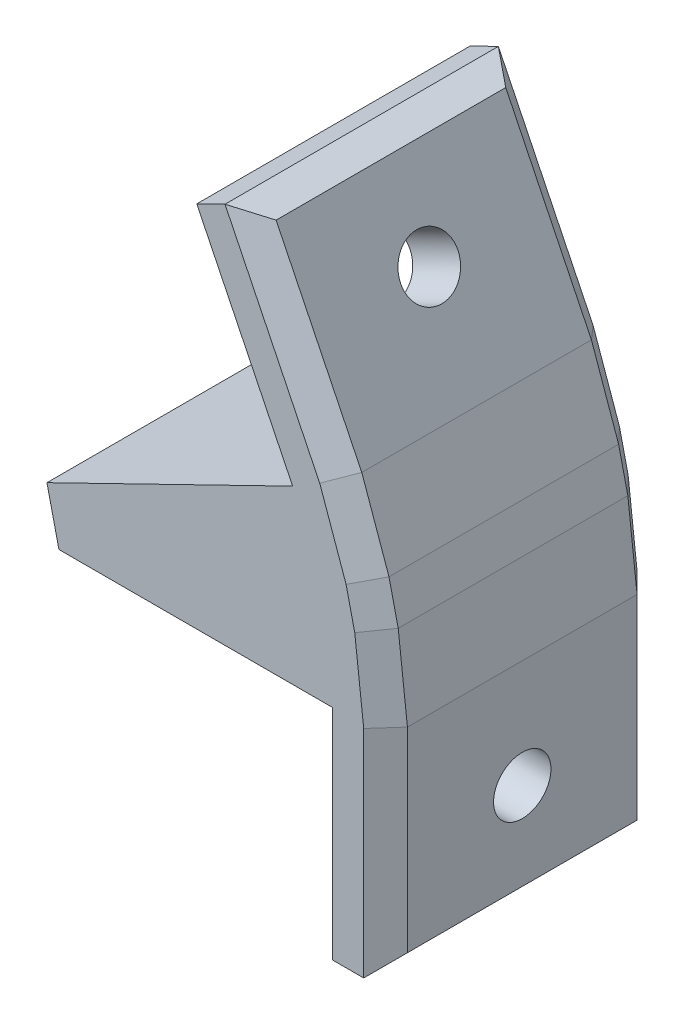
ISO-10303-21;
HEADER;
FILE_DESCRIPTION(('STEP AP214'),'2;1');
FILE_NAME('part.step','',(''),(''),'','','');
FILE_SCHEMA(('AUTOMOTIVE_DESIGN { 1 0 10303 214 1 1 1 1 }'));
ENDSEC;
DATA;
#1=APPLICATION_CONTEXT('core data for automotive mechanical design processes');
#2=APPLICATION_PROTOCOL_DEFINITION('international standard','automotive_design',2000,#1);
#3=PRODUCT_CONTEXT('',#1,'mechanical');
#4=PRODUCT('Part','Part','',(#3));
#5=PRODUCT_RELATED_PRODUCT_CATEGORY('part','',(#4));
#6=PRODUCT_DEFINITION_FORMATION('','',#4);
#7=PRODUCT_DEFINITION_CONTEXT('part definition',#1,'design');
#8=PRODUCT_DEFINITION('design','',#6,#7);
#9=PRODUCT_DEFINITION_SHAPE('','',#8);
#10=(LENGTH_UNIT() NAMED_UNIT(*) SI_UNIT(.MILLI.,.METRE.));
#11=(NAMED_UNIT(*) PLANE_ANGLE_UNIT() SI_UNIT($,.RADIAN.));
#12=(NAMED_UNIT(*) SI_UNIT($,.STERADIAN.) SOLID_ANGLE_UNIT());
#13=UNCERTAINTY_MEASURE_WITH_UNIT(LENGTH_MEASURE(1.E-05),#10,'distance_accuracy_value','');
#14=(GEOMETRIC_REPRESENTATION_CONTEXT(3) GLOBAL_UNCERTAINTY_ASSIGNED_CONTEXT((#13)) GLOBAL_UNIT_ASSIGNED_CONTEXT((#10,
#11,#12)) REPRESENTATION_CONTEXT('',''));
#15=CARTESIAN_POINT('',(0.,0.,0.));
#16=DIRECTION('',(0.,0.,1.));
#17=DIRECTION('',(1.,0.,0.));
#18=AXIS2_PLACEMENT_3D('',#15,#16,#17);
#19=CARTESIAN_POINT('',(0.,0.,20.));
#20=DIRECTION('',(0.,0.,-1.));
#21=DIRECTION('',(-1.,0.,0.));
#22=AXIS2_PLACEMENT_3D('',#19,#20,#21);
#23=PLANE('',#22);
#24=DIRECTION('',(-0.333806859233767,0.94264149109218,0.));
#25=VECTOR('',#24,1.);
#26=CARTESIAN_POINT('',(19.0500213590096,11.8295183172805,20.));
#27=LINE('',#26,#25);
#28=CARTESIAN_POINT('',(21.0096600790083,6.29566928475386,20.));
#29=VERTEX_POINT('',#28);
#30=CARTESIAN_POINT('',(19.0803492424098,11.7438750165536,20.));
#31=VERTEX_POINT('',#30);
#32=EDGE_CURVE('E44',#29,#31,#27,.T.);
#33=ORIENTED_EDGE('',*,*,#32,.T.);
#34=DIRECTION('',(-0.438371146789075,0.898794046299168,0.));
#35=VECTOR('',#34,1.);
#36=CARTESIAN_POINT('',(12.1501618621858,25.9528648250914,20.));
#37=LINE('',#36,#35);
#38=CARTESIAN_POINT('',(12.1501618621858,25.9528648250914,20.));
#39=VERTEX_POINT('',#38);
#40=EDGE_CURVE('E11',#31,#39,#37,.T.);
#41=ORIENTED_EDGE('',*,*,#40,.T.);
#42=DIRECTION('',(-0.898794046299169,-0.438371146789073,0.));
#43=VECTOR('',#42,1.);
#44=CARTESIAN_POINT('',(10.0852002837801,24.9457157691665,20.));
#45=LINE('',#44,#43);
#46=CARTESIAN_POINT('',(10.0852002837801,24.9457157691665,20.));
#47=VERTEX_POINT('',#46);
#48=EDGE_CURVE('E297',#39,#47,#45,.T.);
#49=ORIENTED_EDGE('',*,*,#48,.T.);
#50=DIRECTION('',(0.438371146789074,-0.898794046299169,0.));
#51=VECTOR('',#50,1.);
#52=CARTESIAN_POINT('',(17.0991386324052,10.5650110283798,20.));
#53=LINE('',#52,#51);
#54=CARTESIAN_POINT('',(17.0991386324052,10.5650110283798,20.));
#55=VERTEX_POINT('',#54);
#56=EDGE_CURVE('E301',#47,#55,#53,.T.);
#57=ORIENTED_EDGE('',*,*,#56,.T.);
#58=DIRECTION('',(0.89879404629917,0.438371146789072,0.));
#59=VECTOR('',#58,1.);
#60=CARTESIAN_POINT('',(-0.876742293578144,1.79758809259834,20.));
#61=LINE('',#60,#59);
#62=CARTESIAN_POINT('',(-0.876742293578144,1.79758809259834,20.));
#63=VERTEX_POINT('',#62);
#64=EDGE_CURVE('E168',#63,#55,#61,.T.);
#65=ORIENTED_EDGE('',*,*,#64,.F.);
#66=DIRECTION('',(0.224951054343862,-0.974370064785236,0.));
#67=VECTOR('',#66,1.);
#68=CARTESIAN_POINT('',(0.,-2.,20.));
#69=LINE('',#68,#67);
#70=CARTESIAN_POINT('',(0.,-2.,20.));
#71=VERTEX_POINT('',#70);
#72=EDGE_CURVE('E163',#63,#71,#69,.T.);
#73=ORIENTED_EDGE('',*,*,#72,.T.);
#74=DIRECTION('',(-1.,0.,0.));
#75=VECTOR('',#74,1.);
#76=CARTESIAN_POINT('',(0.,-2.,20.));
#77=LINE('',#76,#75);
#78=CARTESIAN_POINT('',(20.,-2.,20.));
#79=VERTEX_POINT('',#78);
#80=EDGE_CURVE('E169',#79,#71,#77,.T.);
#81=ORIENTED_EDGE('',*,*,#80,.F.);
#82=DIRECTION('',(0.,-1.,0.));
#83=VECTOR('',#82,1.);
#84=CARTESIAN_POINT('',(20.,-2.,20.));
#85=LINE('',#84,#83);
#86=CARTESIAN_POINT('',(20.,-18.,20.));
#87=VERTEX_POINT('',#86);
#88=EDGE_CURVE('E279',#79,#87,#85,.T.);
#89=ORIENTED_EDGE('',*,*,#88,.T.);
#90=DIRECTION('',(1.,0.,0.));
#91=VECTOR('',#90,1.);
#92=CARTESIAN_POINT('',(20.,-18.,20.));
#93=LINE('',#92,#91);
#94=CARTESIAN_POINT('',(22.297480259141,-18.,20.));
#95=VERTEX_POINT('',#94);
#96=EDGE_CURVE('E284',#87,#95,#93,.T.);
#97=ORIENTED_EDGE('',*,*,#96,.T.);
#98=DIRECTION('',(0.,1.,0.));
#99=VECTOR('',#98,1.);
#100=CARTESIAN_POINT('',(22.297480259141,-2.10019578262518,20.));
#101=LINE('',#100,#99);
#102=CARTESIAN_POINT('',(22.297480259141,-2.19105036682883,20.));
#103=VERTEX_POINT('',#102);
#104=EDGE_CURVE('E241',#95,#103,#101,.T.);
#105=ORIENTED_EDGE('',*,*,#104,.T.);
#106=DIRECTION('',(-0.113203213767904,0.993571855676588,0.));
#107=VECTOR('',#106,1.);
#108=CARTESIAN_POINT('',(21.6329121270268,3.64178926970276,20.));
#109=LINE('',#108,#107);
#110=CARTESIAN_POINT('',(21.6431971579443,3.55151871187811,20.));
#111=VERTEX_POINT('',#110);
#112=EDGE_CURVE('E243',#103,#111,#109,.T.);
#113=ORIENTED_EDGE('',*,*,#112,.T.);
#114=DIRECTION('',(-0.224951054343862,0.974370064785236,0.));
#115=VECTOR('',#114,1.);
#116=CARTESIAN_POINT('',(20.9892222444996,6.38419527185088,20.));
#117=LINE('',#116,#115);
#118=EDGE_CURVE('E55',#111,#29,#117,.T.);
#119=ORIENTED_EDGE('',*,*,#118,.T.);
#120=EDGE_LOOP('',(#33,#41,#49,#57,#65,#73,#81,#89,#97,#105,#113,#119));
#121=FACE_BOUND('',#120,.T.);
#122=ADVANCED_FACE('F35',(#121),#23,.F.);
#123=CARTESIAN_POINT('',(0.,0.,0.));
#124=DIRECTION('',(0.,0.,-1.));
#125=DIRECTION('',(-1.,0.,0.));
#126=AXIS2_PLACEMENT_3D('',#123,#124,#125);
#127=PLANE('',#126);
#128=DIRECTION('',(0.113203213767904,-0.993571855676588,0.));
#129=VECTOR('',#128,1.);
#130=CARTESIAN_POINT('',(21.7652992268245,2.47984260727553,0.));
#131=LINE('',#130,#129);
#132=CARTESIAN_POINT('',(21.6431971579443,3.55151871187808,0.));
#133=VERTEX_POINT('',#132);
#134=CARTESIAN_POINT('',(22.297480259141,-2.19105036682883,0.));
#135=VERTEX_POINT('',#134);
#136=EDGE_CURVE('E217',#133,#135,#131,.T.);
#137=ORIENTED_EDGE('',*,*,#136,.T.);
#138=DIRECTION('',(0.,-1.,0.));
#139=VECTOR('',#138,1.);
#140=CARTESIAN_POINT('',(22.297480259141,0.,0.));
#141=LINE('',#140,#139);
#142=CARTESIAN_POINT('',(22.297480259141,-18.,0.));
#143=VERTEX_POINT('',#142);
#144=EDGE_CURVE('E219',#135,#143,#141,.T.);
#145=ORIENTED_EDGE('',*,*,#144,.T.);
#146=DIRECTION('',(1.,0.,0.));
#147=VECTOR('',#146,1.);
#148=CARTESIAN_POINT('',(20.,-18.,0.));
#149=LINE('',#148,#147);
#150=CARTESIAN_POINT('',(20.,-18.,0.));
#151=VERTEX_POINT('',#150);
#152=EDGE_CURVE('E292',#151,#143,#149,.T.);
#153=ORIENTED_EDGE('',*,*,#152,.F.);
#154=DIRECTION('',(0.,-1.,0.));
#155=VECTOR('',#154,1.);
#156=CARTESIAN_POINT('',(20.,0.,0.));
#157=LINE('',#156,#155);
#158=CARTESIAN_POINT('',(20.,-2.,0.));
#159=VERTEX_POINT('',#158);
#160=EDGE_CURVE('E289',#159,#151,#157,.T.);
#161=ORIENTED_EDGE('',*,*,#160,.F.);
#162=DIRECTION('',(1.,0.,0.));
#163=VECTOR('',#162,1.);
#164=CARTESIAN_POINT('',(0.,-2.,0.));
#165=LINE('',#164,#163);
#166=CARTESIAN_POINT('',(0.,-2.,0.));
#167=VERTEX_POINT('',#166);
#168=EDGE_CURVE('E178',#167,#159,#165,.T.);
#169=ORIENTED_EDGE('',*,*,#168,.F.);
#170=DIRECTION('',(0.224951054343862,-0.974370064785236,0.));
#171=VECTOR('',#170,1.);
#172=CARTESIAN_POINT('',(0.,-2.,0.));
#173=LINE('',#172,#171);
#174=CARTESIAN_POINT('',(-0.876742293578144,1.79758809259834,0.));
#175=VERTEX_POINT('',#174);
#176=EDGE_CURVE('E160',#175,#167,#173,.T.);
#177=ORIENTED_EDGE('',*,*,#176,.F.);
#178=DIRECTION('',(-0.89879404629917,-0.438371146789072,0.));
#179=VECTOR('',#178,1.);
#180=CARTESIAN_POINT('',(-0.876742293578144,1.79758809259834,0.));
#181=LINE('',#180,#179);
#182=CARTESIAN_POINT('',(17.0991386324052,10.5650110283798,0.));
#183=VERTEX_POINT('',#182);
#184=EDGE_CURVE('E175',#183,#175,#181,.T.);
#185=ORIENTED_EDGE('',*,*,#184,.F.);
#186=DIRECTION('',(0.438371146789074,-0.898794046299169,0.));
#187=VECTOR('',#186,1.);
#188=CARTESIAN_POINT('',(17.9758809259834,8.76742293578144,0.));
#189=LINE('',#188,#187);
#190=CARTESIAN_POINT('',(10.0852002837801,24.9457157691665,0.));
#191=VERTEX_POINT('',#190);
#192=EDGE_CURVE('E298',#191,#183,#189,.T.);
#193=ORIENTED_EDGE('',*,*,#192,.F.);
#194=DIRECTION('',(-0.898794046299169,-0.438371146789073,0.));
#195=VECTOR('',#194,1.);
#196=CARTESIAN_POINT('',(10.0852002837801,24.9457157691665,0.));
#197=LINE('',#196,#195);
#198=CARTESIAN_POINT('',(12.1501618621858,25.9528648250914,0.));
#199=VERTEX_POINT('',#198);
#200=EDGE_CURVE('E300',#199,#191,#197,.T.);
#201=ORIENTED_EDGE('',*,*,#200,.F.);
#202=DIRECTION('',(0.438371146789075,-0.898794046299168,0.));
#203=VECTOR('',#202,1.);
#204=CARTESIAN_POINT('',(20.0408425043891,9.77457199170637,0.));
#205=LINE('',#204,#203);
#206=CARTESIAN_POINT('',(19.0803492424098,11.7438750165536,0.));
#207=VERTEX_POINT('',#206);
#208=EDGE_CURVE('E211',#199,#207,#205,.T.);
#209=ORIENTED_EDGE('',*,*,#208,.T.);
#210=DIRECTION('',(0.333806859233767,-0.94264149109218,0.));
#211=VECTOR('',#210,1.);
#212=CARTESIAN_POINT('',(20.6496128085976,7.3124114110921,0.));
#213=LINE('',#212,#211);
#214=CARTESIAN_POINT('',(21.0096600790083,6.29566928475387,0.));
#215=VERTEX_POINT('',#214);
#216=EDGE_CURVE('E213',#207,#215,#213,.T.);
#217=ORIENTED_EDGE('',*,*,#216,.T.);
#218=DIRECTION('',(0.224951054343862,-0.974370064785236,0.));
#219=VECTOR('',#218,1.);
#220=CARTESIAN_POINT('',(21.3264286184763,4.92359399831599,0.));
#221=LINE('',#220,#219);
#222=EDGE_CURVE('E215',#215,#133,#221,.T.);
#223=ORIENTED_EDGE('',*,*,#222,.T.);
#224=EDGE_LOOP('',(#137,#145,#153,#161,#169,#177,#185,#193,#201,#209,#217,#223));
#225=FACE_BOUND('',#224,.T.);
#226=ADVANCED_FACE('F173',(#225),#127,.T.);
#227=CARTESIAN_POINT('',(-0.876742293578144,1.79758809259834,0.));
#228=DIRECTION('',(0.438371146789072,-0.89879404629917,0.));
#229=DIRECTION('',(0.89879404629917,0.438371146789072,0.));
#230=AXIS2_PLACEMENT_3D('',#227,#228,#229);
#231=PLANE('',#230);
#232=DIRECTION('',(0.,0.,1.));
#233=VECTOR('',#232,1.);
#234=CARTESIAN_POINT('',(-0.876742293578144,1.79758809259834,20.));
#235=LINE('',#234,#233);
#236=EDGE_CURVE('E157',#175,#63,#235,.T.);
#237=ORIENTED_EDGE('',*,*,#236,.T.);
#238=ORIENTED_EDGE('',*,*,#64,.T.);
#239=DIRECTION('',(0.,0.,-1.));
#240=VECTOR('',#239,1.);
#241=CARTESIAN_POINT('',(17.0991386324052,10.5650110283798,20.));
#242=LINE('',#241,#240);
#243=EDGE_CURVE('E184',#55,#183,#242,.T.);
#244=ORIENTED_EDGE('',*,*,#243,.T.);
#245=ORIENTED_EDGE('',*,*,#184,.T.);
#246=EDGE_LOOP('',(#237,#238,#244,#245));
#247=FACE_BOUND('',#246,.T.);
#248=ADVANCED_FACE('F183',(#247),#231,.F.);
#249=CARTESIAN_POINT('',(0.,-2.,0.));
#250=DIRECTION('',(0.,-1.,0.));
#251=DIRECTION('',(0.,0.,-1.));
#252=AXIS2_PLACEMENT_3D('',#249,#250,#251);
#253=PLANE('',#252);
#254=DIRECTION('',(0.,0.,-1.));
#255=VECTOR('',#254,1.);
#256=CARTESIAN_POINT('',(0.,-2.,20.));
#257=LINE('',#256,#255);
#258=EDGE_CURVE('E309',#71,#167,#257,.T.);
#259=ORIENTED_EDGE('',*,*,#258,.T.);
#260=ORIENTED_EDGE('',*,*,#168,.T.);
#261=DIRECTION('',(0.,0.,1.));
#262=VECTOR('',#261,1.);
#263=CARTESIAN_POINT('',(20.,-2.,20.));
#264=LINE('',#263,#262);
#265=EDGE_CURVE('E312',#159,#79,#264,.T.);
#266=ORIENTED_EDGE('',*,*,#265,.T.);
#267=ORIENTED_EDGE('',*,*,#80,.T.);
#268=EDGE_LOOP('',(#259,#260,#266,#267));
#269=FACE_BOUND('',#268,.T.);
#270=ADVANCED_FACE('F383',(#269),#253,.T.);
#271=CARTESIAN_POINT('',(22.8854207221327,5.28351568526617,0.));
#272=DIRECTION('',(0.974370064785236,0.224951054343862,0.));
#273=DIRECTION('',(-0.224951054343862,0.974370064785236,0.));
#274=AXIS2_PLACEMENT_3D('',#271,#272,#273);
#275=PLANE('',#274);
#276=DIRECTION('',(0.,0.,-1.));
#277=VECTOR('',#276,1.);
#278=CARTESIAN_POINT('',(23.2226270961093,3.82291441173129,0.));
#279=LINE('',#278,#277);
#280=CARTESIAN_POINT('',(23.2226270961093,3.82291441173129,18.4));
#281=VERTEX_POINT('',#280);
#282=CARTESIAN_POINT('',(23.2226270961093,3.82291441173129,1.6));
#283=VERTEX_POINT('',#282);
#284=EDGE_CURVE('E188',#281,#283,#279,.T.);
#285=ORIENTED_EDGE('',*,*,#284,.T.);
#286=DIRECTION('',(-0.224951054343862,0.974370064785236,0.));
#287=VECTOR('',#286,1.);
#288=CARTESIAN_POINT('',(22.8854207221327,5.28351568526617,1.6));
#289=LINE('',#288,#287);
#290=CARTESIAN_POINT('',(22.548214348156,6.74411695880101,1.6));
#291=VERTEX_POINT('',#290);
#292=EDGE_CURVE('E227',#283,#291,#289,.T.);
#293=ORIENTED_EDGE('',*,*,#292,.T.);
#294=DIRECTION('',(0.,0.,1.));
#295=VECTOR('',#294,1.);
#296=CARTESIAN_POINT('',(22.548214348156,6.74411695880101,0.));
#297=LINE('',#296,#295);
#298=CARTESIAN_POINT('',(22.548214348156,6.74411695880101,18.4));
#299=VERTEX_POINT('',#298);
#300=EDGE_CURVE('E185',#291,#299,#297,.T.);
#301=ORIENTED_EDGE('',*,*,#300,.T.);
#302=DIRECTION('',(0.224951054343862,-0.974370064785236,0.));
#303=VECTOR('',#302,1.);
#304=CARTESIAN_POINT('',(23.2226270961093,3.8229144117314,18.4));
#305=LINE('',#304,#303);
#306=EDGE_CURVE('E225',#299,#281,#305,.T.);
#307=ORIENTED_EDGE('',*,*,#306,.T.);
#308=EDGE_LOOP('',(#285,#293,#301,#307));
#309=FACE_BOUND('',#308,.T.);
#310=ADVANCED_FACE('F385',(#309),#275,.T.);
#311=CARTESIAN_POINT('',(17.0991386324052,10.5650110283798,0.));
#312=DIRECTION('',(-0.898794046299168,-0.438371146789074,0.));
#313=DIRECTION('',(0.438371146789074,-0.898794046299168,0.));
#314=AXIS2_PLACEMENT_3D('',#311,#312,#313);
#315=PLANE('',#314);
#316=CARTESIAN_POINT('',(13.5921694580926,17.7553633987732,10.));
#317=DIRECTION('',(-0.898794046299169,-0.438371146789074,0.));
#318=DIRECTION('',(0.438371146789074,-0.898794046299169,0.));
#319=AXIS2_PLACEMENT_3D('',#316,#317,#318);
#320=CIRCLE('',#319,2.1);
#321=CARTESIAN_POINT('',(14.5127488663497,15.8678959015449,10.));
#322=VERTEX_POINT('',#321);
#323=EDGE_CURVE('E358',#322,#322,#320,.T.);
#324=ORIENTED_EDGE('',*,*,#323,.F.);
#325=EDGE_LOOP('',(#324));
#326=FACE_BOUND('',#325,.T.);
#327=ORIENTED_EDGE('',*,*,#243,.F.);
#328=ORIENTED_EDGE('',*,*,#56,.F.);
#329=DIRECTION('',(0.,0.,1.));
#330=VECTOR('',#329,1.);
#331=CARTESIAN_POINT('',(10.0852002837801,24.9457157691665,0.));
#332=LINE('',#331,#330);
#333=EDGE_CURVE('E303',#191,#47,#332,.T.);
#334=ORIENTED_EDGE('',*,*,#333,.F.);
#335=ORIENTED_EDGE('',*,*,#192,.T.);
#336=EDGE_LOOP('',(#327,#328,#334,#335));
#337=FACE_BOUND('',#336,.T.);
#338=ADVANCED_FACE('F320',(#326,#337),#315,.T.);
#339=CARTESIAN_POINT('',(10.0852002837801,24.9457157691665,0.));
#340=DIRECTION('',(-0.438371146789073,0.898794046299169,0.));
#341=DIRECTION('',(-0.898794046299169,-0.438371146789073,0.));
#342=AXIS2_PLACEMENT_3D('',#339,#340,#341);
#343=PLANE('',#342);
#344=ORIENTED_EDGE('',*,*,#48,.F.);
#345=DIRECTION('',(0.,0.,-1.));
#346=VECTOR('',#345,1.);
#347=CARTESIAN_POINT('',(12.1501618621858,25.9528648250914,0.));
#348=LINE('',#347,#346);
#349=EDGE_CURVE('E239',#39,#199,#348,.T.);
#350=ORIENTED_EDGE('',*,*,#349,.T.);
#351=ORIENTED_EDGE('',*,*,#200,.T.);
#352=ORIENTED_EDGE('',*,*,#333,.T.);
#353=EDGE_LOOP('',(#344,#350,#351,#352));
#354=FACE_BOUND('',#353,.T.);
#355=ADVANCED_FACE('F479',(#354),#343,.T.);
#356=CARTESIAN_POINT('',(13.5882323362645,26.6542586599539,0.));
#357=DIRECTION('',(0.898794046299168,0.438371146789074,0.));
#358=DIRECTION('',(-0.438371146789074,0.898794046299168,0.));
#359=AXIS2_PLACEMENT_3D('',#356,#357,#358);
#360=PLANE('',#359);
#361=CARTESIAN_POINT('',(17.0952015105771,19.4639062895606,10.));
#362=DIRECTION('',(0.898794046299168,0.438371146789074,0.));
#363=DIRECTION('',(-0.438371146789074,0.898794046299168,0.));
#364=AXIS2_PLACEMENT_3D('',#361,#362,#363);
#365=CIRCLE('',#364,2.1);
#366=CARTESIAN_POINT('',(16.17462210232,21.3513737867888,10.));
#367=VERTEX_POINT('',#366);
#368=EDGE_CURVE('E39',#367,#367,#365,.T.);
#369=ORIENTED_EDGE('',*,*,#368,.F.);
#370=EDGE_LOOP('',(#369));
#371=FACE_BOUND('',#370,.T.);
#372=DIRECTION('',(0.,0.,-1.));
#373=VECTOR('',#372,1.);
#374=CARTESIAN_POINT('',(20.5582477447571,12.3636092920545,0.));
#375=LINE('',#374,#373);
#376=CARTESIAN_POINT('',(20.5582477447571,12.3636092920545,18.4));
#377=VERTEX_POINT('',#376);
#378=CARTESIAN_POINT('',(20.5582477447571,12.3636092920545,1.6));
#379=VERTEX_POINT('',#378);
#380=EDGE_CURVE('E198',#377,#379,#375,.T.);
#381=ORIENTED_EDGE('',*,*,#380,.T.);
#382=DIRECTION('',(-0.438371146789074,0.898794046299168,0.));
#383=VECTOR('',#382,1.);
#384=CARTESIAN_POINT('',(13.5882323362645,26.6542586599539,1.6));
#385=LINE('',#384,#383);
#386=CARTESIAN_POINT('',(14.289626171127,25.2161881858752,1.6));
#387=VERTEX_POINT('',#386);
#388=EDGE_CURVE('E237',#379,#387,#385,.T.);
#389=ORIENTED_EDGE('',*,*,#388,.T.);
#390=DIRECTION('',(0.,0.,1.));
#391=VECTOR('',#390,1.);
#392=CARTESIAN_POINT('',(14.289626171127,25.2161881858752,0.));
#393=LINE('',#392,#391);
#394=CARTESIAN_POINT('',(14.289626171127,25.2161881858752,18.4));
#395=VERTEX_POINT('',#394);
#396=EDGE_CURVE('E235',#387,#395,#393,.T.);
#397=ORIENTED_EDGE('',*,*,#396,.T.);
#398=DIRECTION('',(0.438371146789074,-0.898794046299168,0.));
#399=VECTOR('',#398,1.);
#400=CARTESIAN_POINT('',(20.5582477447571,12.3636092920545,18.4));
#401=LINE('',#400,#399);
#402=EDGE_CURVE('E233',#395,#377,#401,.T.);
#403=ORIENTED_EDGE('',*,*,#402,.T.);
#404=EDGE_LOOP('',(#381,#389,#397,#403));
#405=FACE_BOUND('',#404,.T.);
#406=ADVANCED_FACE('F471',(#371,#405),#360,.T.);
#407=CARTESIAN_POINT('',(23.897480259141,-18.,0.));
#408=DIRECTION('',(1.,0.,0.));
#409=DIRECTION('',(0.,1.,0.));
#410=AXIS2_PLACEMENT_3D('',#407,#408,#409);
#411=PLANE('',#410);
#412=CARTESIAN_POINT('',(23.897480259141,-10.,10.));
#413=DIRECTION('',(-1.,0.,0.));
#414=DIRECTION('',(0.,-1.,0.));
#415=AXIS2_PLACEMENT_3D('',#412,#413,#414);
#416=CIRCLE('',#415,2.1);
#417=CARTESIAN_POINT('',(23.897480259141,-12.1,10.));
#418=VERTEX_POINT('',#417);
#419=EDGE_CURVE('E361',#418,#418,#416,.T.);
#420=ORIENTED_EDGE('',*,*,#419,.T.);
#421=EDGE_LOOP('',(#420));
#422=FACE_BOUND('',#421,.T.);
#423=DIRECTION('',(0.,0.,-1.));
#424=VECTOR('',#423,1.);
#425=CARTESIAN_POINT('',(23.897480259141,-16.4,0.));
#426=LINE('',#425,#424);
#427=CARTESIAN_POINT('',(23.897480259141,-16.4,18.4));
#428=VERTEX_POINT('',#427);
#429=CARTESIAN_POINT('',(23.897480259141,-16.4,1.6));
#430=VERTEX_POINT('',#429);
#431=EDGE_CURVE('E206',#428,#430,#426,.T.);
#432=ORIENTED_EDGE('',*,*,#431,.T.);
#433=DIRECTION('',(0.,1.,0.));
#434=VECTOR('',#433,1.);
#435=CARTESIAN_POINT('',(23.897480259141,-18.,1.6));
#436=LINE('',#435,#434);
#437=CARTESIAN_POINT('',(23.897480259141,-2.10019578262467,1.6));
#438=VERTEX_POINT('',#437);
#439=EDGE_CURVE('E209',#430,#438,#436,.T.);
#440=ORIENTED_EDGE('',*,*,#439,.T.);
#441=DIRECTION('',(0.,0.,1.));
#442=VECTOR('',#441,1.);
#443=CARTESIAN_POINT('',(23.897480259141,-2.10019578262467,0.));
#444=LINE('',#443,#442);
#445=CARTESIAN_POINT('',(23.897480259141,-2.10019578262467,18.4));
#446=VERTEX_POINT('',#445);
#447=EDGE_CURVE('E195',#438,#446,#444,.T.);
#448=ORIENTED_EDGE('',*,*,#447,.T.);
#449=DIRECTION('',(0.,-1.,0.));
#450=VECTOR('',#449,1.);
#451=CARTESIAN_POINT('',(23.897480259141,-18.,18.4));
#452=LINE('',#451,#450);
#453=EDGE_CURVE('E204',#446,#428,#452,.T.);
#454=ORIENTED_EDGE('',*,*,#453,.T.);
#455=EDGE_LOOP('',(#432,#440,#448,#454));
#456=FACE_BOUND('',#455,.T.);
#457=ADVANCED_FACE('F368',(#422,#456),#411,.T.);
#458=CARTESIAN_POINT('',(20.,-18.,0.));
#459=DIRECTION('',(0.,-1.,0.));
#460=DIRECTION('',(0.,0.,-1.));
#461=AXIS2_PLACEMENT_3D('',#458,#459,#460);
#462=PLANE('',#461);
#463=ORIENTED_EDGE('',*,*,#152,.T.);
#464=DIRECTION('',(0.,0.,1.));
#465=VECTOR('',#464,1.);
#466=CARTESIAN_POINT('',(22.297480259141,-18.,0.));
#467=LINE('',#466,#465);
#468=EDGE_CURVE('E201',#143,#95,#467,.T.);
#469=ORIENTED_EDGE('',*,*,#468,.T.);
#470=ORIENTED_EDGE('',*,*,#96,.F.);
#471=DIRECTION('',(0.,0.,1.));
#472=VECTOR('',#471,1.);
#473=CARTESIAN_POINT('',(20.,-18.,0.));
#474=LINE('',#473,#472);
#475=EDGE_CURVE('E295',#151,#87,#474,.T.);
#476=ORIENTED_EDGE('',*,*,#475,.F.);
#477=EDGE_LOOP('',(#463,#469,#470,#476));
#478=FACE_BOUND('',#477,.T.);
#479=ADVANCED_FACE('F354',(#478),#462,.T.);
#480=CARTESIAN_POINT('',(20.,-2.,0.));
#481=DIRECTION('',(-1.,0.,0.));
#482=DIRECTION('',(0.,-1.,0.));
#483=AXIS2_PLACEMENT_3D('',#480,#481,#482);
#484=PLANE('',#483);
#485=CARTESIAN_POINT('',(20.,-10.,10.));
#486=DIRECTION('',(-1.,0.,0.));
#487=DIRECTION('',(0.,-1.,0.));
#488=AXIS2_PLACEMENT_3D('',#485,#486,#487);
#489=CIRCLE('',#488,2.1);
#490=CARTESIAN_POINT('',(20.,-12.1,10.));
#491=VERTEX_POINT('',#490);
#492=EDGE_CURVE('E180',#491,#491,#489,.T.);
#493=ORIENTED_EDGE('',*,*,#492,.F.);
#494=EDGE_LOOP('',(#493));
#495=FACE_BOUND('',#494,.T.);
#496=ORIENTED_EDGE('',*,*,#88,.F.);
#497=ORIENTED_EDGE('',*,*,#265,.F.);
#498=ORIENTED_EDGE('',*,*,#160,.T.);
#499=ORIENTED_EDGE('',*,*,#475,.T.);
#500=EDGE_LOOP('',(#496,#497,#498,#499));
#501=FACE_BOUND('',#500,.T.);
#502=ADVANCED_FACE('F378',(#495,#501),#484,.T.);
#503=CARTESIAN_POINT('',(23.2226270961093,3.82291441173129,0.));
#504=DIRECTION('',(-0.993571855676588,-0.113203213767904,0.));
#505=DIRECTION('',(0.,0.,-1.));
#506=AXIS2_PLACEMENT_3D('',#503,#504,#505);
#507=PLANE('',#506);
#508=ORIENTED_EDGE('',*,*,#447,.F.);
#509=DIRECTION('',(0.113203213767904,-0.993571855676588,0.));
#510=VECTOR('',#509,1.);
#511=CARTESIAN_POINT('',(23.2226270961093,3.82291441173129,1.6));
#512=LINE('',#511,#510);
#513=EDGE_CURVE('E223',#438,#283,#512,.F.);
#514=ORIENTED_EDGE('',*,*,#513,.T.);
#515=ORIENTED_EDGE('',*,*,#284,.F.);
#516=DIRECTION('',(-0.113203213767904,0.993571855676588,0.));
#517=VECTOR('',#516,1.);
#518=CARTESIAN_POINT('',(23.897480259141,-2.10019578262518,18.4));
#519=LINE('',#518,#517);
#520=EDGE_CURVE('E221',#281,#446,#519,.F.);
#521=ORIENTED_EDGE('',*,*,#520,.T.);
#522=EDGE_LOOP('',(#508,#514,#515,#521));
#523=FACE_BOUND('',#522,.T.);
#524=ADVANCED_FACE('F380',(#523),#507,.F.);
#525=CARTESIAN_POINT('',(22.548214348156,6.74411695880102,0.));
#526=DIRECTION('',(-0.94264149109218,-0.333806859233767,0.));
#527=DIRECTION('',(0.,0.,1.));
#528=AXIS2_PLACEMENT_3D('',#525,#526,#527);
#529=PLANE('',#528);
#530=ORIENTED_EDGE('',*,*,#300,.F.);
#531=DIRECTION('',(0.333806859233767,-0.94264149109218,0.));
#532=VECTOR('',#531,1.);
#533=CARTESIAN_POINT('',(22.548214348156,6.74411695880102,1.6));
#534=LINE('',#533,#532);
#535=EDGE_CURVE('E231',#291,#379,#534,.F.);
#536=ORIENTED_EDGE('',*,*,#535,.T.);
#537=ORIENTED_EDGE('',*,*,#380,.F.);
#538=DIRECTION('',(-0.333806859233767,0.94264149109218,0.));
#539=VECTOR('',#538,1.);
#540=CARTESIAN_POINT('',(22.548214348156,6.74411695880106,18.4));
#541=LINE('',#540,#539);
#542=EDGE_CURVE('E229',#377,#299,#541,.F.);
#543=ORIENTED_EDGE('',*,*,#542,.T.);
#544=EDGE_LOOP('',(#530,#536,#537,#543));
#545=FACE_BOUND('',#544,.T.);
#546=ADVANCED_FACE('F403',(#545),#529,.F.);
#547=CARTESIAN_POINT('',(14.289626171127,25.2161881858752,0.));
#548=DIRECTION('',(-0.325568154457159,-0.945518575599316,0.));
#549=DIRECTION('',(0.,0.,1.));
#550=AXIS2_PLACEMENT_3D('',#547,#548,#549);
#551=PLANE('',#550);
#552=DIRECTION('',(0.772012684180494,-0.265825284973219,-0.577350269189627));
#553=VECTOR('',#552,1.);
#554=CARTESIAN_POINT('',(20.1731530207152,23.1903274280308,14.));
#555=LINE('',#554,#553);
#556=EDGE_CURVE('E275',#395,#39,#555,.F.);
#557=ORIENTED_EDGE('',*,*,#556,.F.);
#558=ORIENTED_EDGE('',*,*,#396,.F.);
#559=DIRECTION('',(-0.772012684180497,0.26582528497322,-0.577350269189623));
#560=VECTOR('',#559,1.);
#561=CARTESIAN_POINT('',(13.5764714014799,25.4617470656139,1.06666666666667));
#562=LINE('',#561,#560);
#563=EDGE_CURVE('E277',#199,#387,#562,.F.);
#564=ORIENTED_EDGE('',*,*,#563,.F.);
#565=ORIENTED_EDGE('',*,*,#349,.F.);
#566=EDGE_LOOP('',(#557,#558,#564,#565));
#567=FACE_BOUND('',#566,.T.);
#568=ADVANCED_FACE('F37',(#567),#551,.F.);
#569=CARTESIAN_POINT('',(13.5882323362645,26.6542586599539,1.6));
#570=DIRECTION('',(-0.635543365028235,-0.309975210571077,0.70710678118655));
#571=DIRECTION('',(-0.438371146789075,0.898794046299169,0.));
#572=AXIS2_PLACEMENT_3D('',#569,#570,#571);
#573=PLANE('',#572);
#574=ORIENTED_EDGE('',*,*,#563,.T.);
#575=ORIENTED_EDGE('',*,*,#388,.F.);
#576=DIRECTION('',(0.652619162804186,0.27366592725831,0.706537464398465));
#577=VECTOR('',#576,1.);
#578=CARTESIAN_POINT('',(20.1419407994114,12.1890373016574,1.14929847246268));
#579=LINE('',#578,#577);
#580=EDGE_CURVE('E272',#207,#379,#579,.T.);
#581=ORIENTED_EDGE('',*,*,#580,.F.);
#582=ORIENTED_EDGE('',*,*,#208,.F.);
#583=EDGE_LOOP('',(#574,#575,#581,#582));
#584=FACE_BOUND('',#583,.T.);
#585=ADVANCED_FACE('F328',(#584),#573,.F.);
#586=CARTESIAN_POINT('',(20.0408425043891,9.77457199170637,20.));
#587=DIRECTION('',(0.635543365028238,0.309975210571078,0.707106781186547));
#588=DIRECTION('',(0.438371146789075,-0.898794046299169,0.));
#589=AXIS2_PLACEMENT_3D('',#586,#587,#588);
#590=PLANE('',#589);
#591=ORIENTED_EDGE('',*,*,#556,.T.);
#592=ORIENTED_EDGE('',*,*,#40,.F.);
#593=DIRECTION('',(0.652619162804208,0.273665927258253,-0.706537464398467));
#594=VECTOR('',#593,1.);
#595=CARTESIAN_POINT('',(18.9572593151682,11.6922591263153,20.1332594107604));
#596=LINE('',#595,#594);
#597=EDGE_CURVE('E269',#377,#31,#596,.F.);
#598=ORIENTED_EDGE('',*,*,#597,.F.);
#599=ORIENTED_EDGE('',*,*,#402,.F.);
#600=EDGE_LOOP('',(#591,#592,#598,#599));
#601=FACE_BOUND('',#600,.T.);
#602=ADVANCED_FACE('F436',(#601),#590,.T.);
#603=CARTESIAN_POINT('',(20.6496128085976,7.3124114110921,0.));
#604=DIRECTION('',(0.666548190579081,0.236037093770781,-0.707106781186545));
#605=DIRECTION('',(-0.333806859233767,0.94264149109218,0.));
#606=AXIS2_PLACEMENT_3D('',#603,#604,#605);
#607=PLANE('',#606);
#608=ORIENTED_EDGE('',*,*,#580,.T.);
#609=ORIENTED_EDGE('',*,*,#535,.F.);
#610=DIRECTION('',(0.679403895101917,0.19802817658538,0.706537464398466));
#611=VECTOR('',#610,1.);
#612=CARTESIAN_POINT('',(20.98025960336,6.28709982757923,-0.0305746517887004));
#613=LINE('',#612,#611);
#614=EDGE_CURVE('E266',#215,#291,#613,.T.);
#615=ORIENTED_EDGE('',*,*,#614,.F.);
#616=ORIENTED_EDGE('',*,*,#216,.F.);
#617=EDGE_LOOP('',(#608,#609,#615,#616));
#618=FACE_BOUND('',#617,.T.);
#619=ADVANCED_FACE('F333',(#618),#607,.T.);
#620=CARTESIAN_POINT('',(20.6496128085976,7.3124114110921,20.));
#621=DIRECTION('',(-0.666548190579081,-0.236037093770781,-0.707106781186545));
#622=DIRECTION('',(-0.333806859233767,0.94264149109218,0.));
#623=AXIS2_PLACEMENT_3D('',#620,#621,#622);
#624=PLANE('',#623);
#625=ORIENTED_EDGE('',*,*,#597,.T.);
#626=ORIENTED_EDGE('',*,*,#32,.F.);
#627=DIRECTION('',(0.679403895101904,0.198028176585419,-0.706537464398467));
#628=VECTOR('',#627,1.);
#629=CARTESIAN_POINT('',(22.5073543980021,6.73220736940555,18.4424917869698));
#630=LINE('',#629,#628);
#631=EDGE_CURVE('E263',#299,#29,#630,.F.);
#632=ORIENTED_EDGE('',*,*,#631,.F.);
#633=ORIENTED_EDGE('',*,*,#542,.F.);
#634=EDGE_LOOP('',(#625,#626,#632,#633));
#635=FACE_BOUND('',#634,.T.);
#636=ADVANCED_FACE('F430',(#635),#624,.F.);
#637=CARTESIAN_POINT('',(22.8854207221327,5.28351568526617,1.6));
#638=DIRECTION('',(-0.688983680194814,-0.159064415961608,0.70710678118655));
#639=DIRECTION('',(-0.224951054343862,0.974370064785236,0.));
#640=AXIS2_PLACEMENT_3D('',#637,#638,#639);
#641=PLANE('',#640);
#642=ORIENTED_EDGE('',*,*,#614,.T.);
#643=ORIENTED_EDGE('',*,*,#292,.F.);
#644=DIRECTION('',(0.697454014816353,0.119844518514358,0.706537464398465));
#645=VECTOR('',#644,1.);
#646=CARTESIAN_POINT('',(23.1806815958179,3.81570685656716,1.55750821303018));
#647=LINE('',#646,#645);
#648=EDGE_CURVE('E260',#133,#283,#647,.T.);
#649=ORIENTED_EDGE('',*,*,#648,.F.);
#650=ORIENTED_EDGE('',*,*,#222,.F.);
#651=EDGE_LOOP('',(#642,#643,#649,#650));
#652=FACE_BOUND('',#651,.T.);
#653=ADVANCED_FACE('F340',(#652),#641,.F.);
#654=CARTESIAN_POINT('',(22.8854207221327,5.28351568526617,18.4));
#655=DIRECTION('',(0.688983680194816,0.159064415961608,0.707106781186547));
#656=DIRECTION('',(-0.224951054343862,0.974370064785236,0.));
#657=AXIS2_PLACEMENT_3D('',#654,#655,#656);
#658=PLANE('',#657);
#659=ORIENTED_EDGE('',*,*,#631,.T.);
#660=ORIENTED_EDGE('',*,*,#118,.F.);
#661=DIRECTION('',(0.697454014816358,0.119844518514318,-0.706537464398467));
#662=VECTOR('',#661,1.);
#663=CARTESIAN_POINT('',(21.6130155827043,3.54633256874064,20.0305746517887));
#664=LINE('',#663,#662);
#665=EDGE_CURVE('E257',#281,#111,#664,.F.);
#666=ORIENTED_EDGE('',*,*,#665,.F.);
#667=ORIENTED_EDGE('',*,*,#306,.F.);
#668=EDGE_LOOP('',(#659,#660,#666,#667));
#669=FACE_BOUND('',#668,.T.);
#670=ADVANCED_FACE('F424',(#669),#658,.T.);
#671=CARTESIAN_POINT('',(21.7652992268245,2.47984260727553,0.));
#672=DIRECTION('',(0.702561396745018,0.0800467601073956,-0.707106781186546));
#673=DIRECTION('',(-0.113203213767904,0.993571855676588,0.));
#674=AXIS2_PLACEMENT_3D('',#671,#672,#673);
#675=PLANE('',#674);
#676=ORIENTED_EDGE('',*,*,#648,.T.);
#677=ORIENTED_EDGE('',*,*,#513,.F.);
#678=DIRECTION('',(0.706537464398465,0.0401201047203685,0.706537464398467));
#679=VECTOR('',#678,1.);
#680=CARTESIAN_POINT('',(22.1642208483806,-2.19861738455129,-0.133259410760332));
#681=LINE('',#680,#679);
#682=EDGE_CURVE('E254',#135,#438,#681,.T.);
#683=ORIENTED_EDGE('',*,*,#682,.F.);
#684=ORIENTED_EDGE('',*,*,#136,.F.);
#685=EDGE_LOOP('',(#676,#677,#683,#684));
#686=FACE_BOUND('',#685,.T.);
#687=ADVANCED_FACE('F343',(#686),#675,.T.);
#688=CARTESIAN_POINT('',(21.7652992268245,2.47984260727553,20.));
#689=DIRECTION('',(-0.702561396745019,-0.0800467601073957,-0.707106781186546));
#690=DIRECTION('',(-0.113203213767904,0.993571855676588,0.));
#691=AXIS2_PLACEMENT_3D('',#688,#689,#690);
#692=PLANE('',#691);
#693=ORIENTED_EDGE('',*,*,#665,.T.);
#694=ORIENTED_EDGE('',*,*,#112,.F.);
#695=DIRECTION('',(0.706537464398464,0.0401201047203685,-0.706537464398467));
#696=VECTOR('',#695,1.);
#697=CARTESIAN_POINT('',(22.3595885551767,-2.18752360219637,19.9378917039643));
#698=LINE('',#697,#696);
#699=EDGE_CURVE('E251',#446,#103,#698,.F.);
#700=ORIENTED_EDGE('',*,*,#699,.F.);
#701=ORIENTED_EDGE('',*,*,#520,.F.);
#702=EDGE_LOOP('',(#693,#694,#700,#701));
#703=FACE_BOUND('',#702,.T.);
#704=ADVANCED_FACE('F418',(#703),#692,.F.);
#705=CARTESIAN_POINT('',(23.897480259141,-18.,1.6));
#706=DIRECTION('',(-0.707106781186549,0.,0.707106781186546));
#707=DIRECTION('',(0.,1.,0.));
#708=AXIS2_PLACEMENT_3D('',#705,#706,#707);
#709=PLANE('',#708);
#710=ORIENTED_EDGE('',*,*,#682,.T.);
#711=ORIENTED_EDGE('',*,*,#439,.F.);
#712=DIRECTION('',(-0.577350269189624,-0.577350269189627,-0.577350269189626));
#713=VECTOR('',#712,1.);
#714=CARTESIAN_POINT('',(23.3641469258076,-16.9333333333333,1.06666666666667));
#715=LINE('',#714,#713);
#716=EDGE_CURVE('E249',#143,#430,#715,.F.);
#717=ORIENTED_EDGE('',*,*,#716,.F.);
#718=ORIENTED_EDGE('',*,*,#144,.F.);
#719=EDGE_LOOP('',(#710,#711,#717,#718));
#720=FACE_BOUND('',#719,.T.);
#721=ADVANCED_FACE('F348',(#720),#709,.F.);
#722=CARTESIAN_POINT('',(22.297480259141,0.,20.));
#723=DIRECTION('',(0.707106781186549,0.,0.707106781186546));
#724=DIRECTION('',(0.,-1.,0.));
#725=AXIS2_PLACEMENT_3D('',#722,#723,#724);
#726=PLANE('',#725);
#727=ORIENTED_EDGE('',*,*,#699,.T.);
#728=ORIENTED_EDGE('',*,*,#104,.F.);
#729=DIRECTION('',(-0.577350269189624,-0.577350269189627,0.577350269189627));
#730=VECTOR('',#729,1.);
#731=CARTESIAN_POINT('',(28.297480259141,-12.,14.));
#732=LINE('',#731,#730);
#733=EDGE_CURVE('E247',#428,#95,#732,.T.);
#734=ORIENTED_EDGE('',*,*,#733,.F.);
#735=ORIENTED_EDGE('',*,*,#453,.F.);
#736=EDGE_LOOP('',(#727,#728,#734,#735));
#737=FACE_BOUND('',#736,.T.);
#738=ADVANCED_FACE('F411',(#737),#726,.T.);
#739=CARTESIAN_POINT('',(22.297480259141,-18.,0.));
#740=DIRECTION('',(-0.707106781186549,0.707106781186546,0.));
#741=DIRECTION('',(0.,0.,1.));
#742=AXIS2_PLACEMENT_3D('',#739,#740,#741);
#743=PLANE('',#742);
#744=ORIENTED_EDGE('',*,*,#716,.T.);
#745=ORIENTED_EDGE('',*,*,#431,.F.);
#746=ORIENTED_EDGE('',*,*,#733,.T.);
#747=ORIENTED_EDGE('',*,*,#468,.F.);
#748=EDGE_LOOP('',(#744,#745,#746,#747));
#749=FACE_BOUND('',#748,.T.);
#750=ADVANCED_FACE('F408',(#749),#743,.F.);
#751=CARTESIAN_POINT('',(25.1469759226708,23.3910190661194,10.));
#752=DIRECTION('',(-0.898794046299168,-0.438371146789074,0.));
#753=DIRECTION('',(0.438371146789074,-0.898794046299168,0.));
#754=AXIS2_PLACEMENT_3D('',#751,#752,#753);
#755=CYLINDRICAL_SURFACE('',#754,2.1);
#756=ORIENTED_EDGE('',*,*,#368,.T.);
#757=EDGE_LOOP('',(#756));
#758=FACE_BOUND('',#757,.T.);
#759=ORIENTED_EDGE('',*,*,#323,.T.);
#760=EDGE_LOOP('',(#759));
#761=FACE_BOUND('',#760,.T.);
#762=ADVANCED_FACE('F374',(#758,#761),#755,.F.);
#763=CARTESIAN_POINT('',(23.897480259141,-10.,10.));
#764=DIRECTION('',(-1.,0.,0.));
#765=DIRECTION('',(0.,-1.,0.));
#766=AXIS2_PLACEMENT_3D('',#763,#764,#765);
#767=CYLINDRICAL_SURFACE('',#766,2.1);
#768=ORIENTED_EDGE('',*,*,#419,.F.);
#769=EDGE_LOOP('',(#768));
#770=FACE_BOUND('',#769,.T.);
#771=ORIENTED_EDGE('',*,*,#492,.T.);
#772=EDGE_LOOP('',(#771));
#773=FACE_BOUND('',#772,.T.);
#774=ADVANCED_FACE('F371',(#770,#773),#767,.F.);
#775=CARTESIAN_POINT('',(0.,-2.,0.));
#776=DIRECTION('',(-0.974370064785236,-0.224951054343862,0.));
#777=DIRECTION('',(0.224951054343862,-0.974370064785236,0.));
#778=AXIS2_PLACEMENT_3D('',#775,#776,#777);
#779=PLANE('',#778);
#780=ORIENTED_EDGE('',*,*,#72,.F.);
#781=ORIENTED_EDGE('',*,*,#236,.F.);
#782=ORIENTED_EDGE('',*,*,#176,.T.);
#783=ORIENTED_EDGE('',*,*,#258,.F.);
#784=EDGE_LOOP('',(#780,#781,#782,#783));
#785=FACE_BOUND('',#784,.T.);
#786=ADVANCED_FACE('F159',(#785),#779,.T.);
#787=CLOSED_SHELL('',(#122,#226,#248,#270,#310,#338,#355,#406,#457,#479,#502,#524,#546,#568,
#585,#602,#619,#636,#653,#670,#687,#704,#721,#738,#750,#762,#774,#786));
#788=MANIFOLD_SOLID_BREP('B2',#787);
#789=ADVANCED_BREP_SHAPE_REPRESENTATION('',(#18,#788),#14);
#790=SHAPE_DEFINITION_REPRESENTATION(#9,#789);
ENDSEC;
END-ISO-10303-21;
